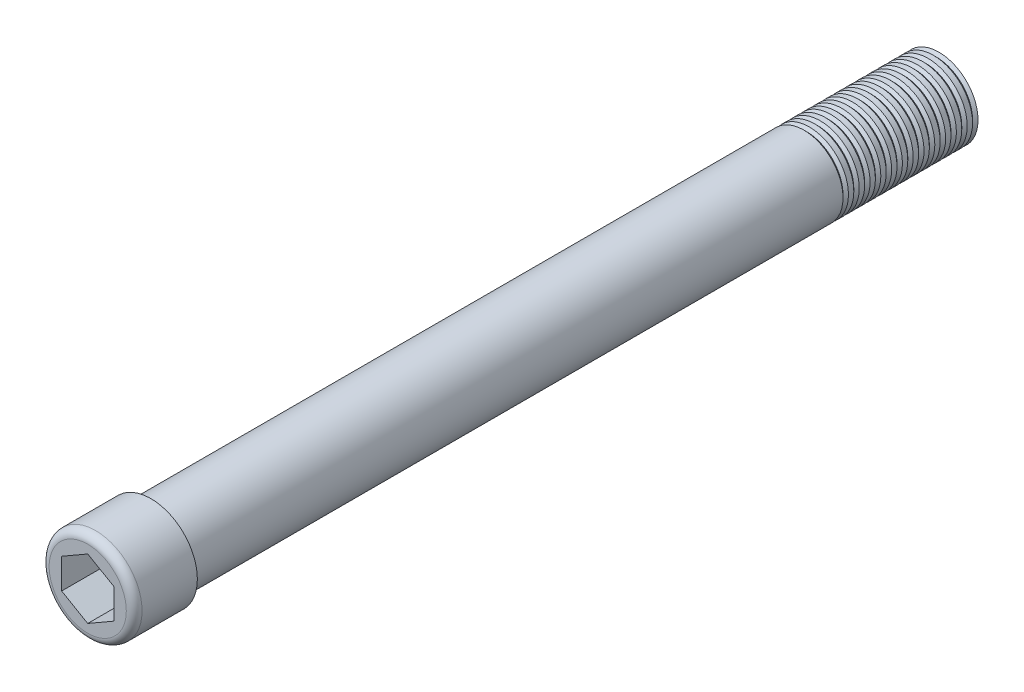
ISO-10303-21;
HEADER;
FILE_DESCRIPTION(('STEP AP214'),'2;1');
FILE_NAME('part.step','',(''),(''),'','','');
FILE_SCHEMA(('AUTOMOTIVE_DESIGN { 1 0 10303 214 1 1 1 1 }'));
ENDSEC;
DATA;
#1=APPLICATION_CONTEXT('core data for automotive mechanical design processes');
#2=APPLICATION_PROTOCOL_DEFINITION('international standard','automotive_design',2000,#1);
#3=PRODUCT_CONTEXT('',#1,'mechanical');
#4=PRODUCT('Part','Part','',(#3));
#5=PRODUCT_RELATED_PRODUCT_CATEGORY('part','',(#4));
#6=PRODUCT_DEFINITION_FORMATION('','',#4);
#7=PRODUCT_DEFINITION_CONTEXT('part definition',#1,'design');
#8=PRODUCT_DEFINITION('design','',#6,#7);
#9=PRODUCT_DEFINITION_SHAPE('','',#8);
#10=(LENGTH_UNIT() NAMED_UNIT(*) SI_UNIT(.MILLI.,.METRE.));
#11=(NAMED_UNIT(*) PLANE_ANGLE_UNIT() SI_UNIT($,.RADIAN.));
#12=(NAMED_UNIT(*) SI_UNIT($,.STERADIAN.) SOLID_ANGLE_UNIT());
#13=UNCERTAINTY_MEASURE_WITH_UNIT(LENGTH_MEASURE(1.E-05),#10,'distance_accuracy_value','');
#14=(GEOMETRIC_REPRESENTATION_CONTEXT(3) GLOBAL_UNCERTAINTY_ASSIGNED_CONTEXT((#13)) GLOBAL_UNIT_ASSIGNED_CONTEXT((#10,
#11,#12)) REPRESENTATION_CONTEXT('',''));
#15=CARTESIAN_POINT('',(0.,0.,0.));
#16=DIRECTION('',(0.,0.,1.));
#17=DIRECTION('',(1.,0.,0.));
#18=AXIS2_PLACEMENT_3D('',#15,#16,#17);
#19=CARTESIAN_POINT('',(0.,0.,127.));
#20=DIRECTION('',(0.,0.,-1.));
#21=DIRECTION('',(-1.,0.,0.));
#22=AXIS2_PLACEMENT_3D('',#19,#20,#21);
#23=CYLINDRICAL_SURFACE('',#22,6.3);
#24=CARTESIAN_POINT('',(0.,0.,20.01735315459));
#25=DIRECTION('',(0.,0.,1.));
#26=DIRECTION('',(1.,0.,0.));
#27=AXIS2_PLACEMENT_3D('',#24,#25,#26);
#28=CIRCLE('',#27,6.3);
#29=CARTESIAN_POINT('',(6.3,0.,20.01735315459));
#30=VERTEX_POINT('',#29);
#31=EDGE_CURVE('E751',#30,#30,#28,.T.);
#32=ORIENTED_EDGE('',*,*,#31,.T.);
#33=EDGE_LOOP('',(#32));
#34=FACE_BOUND('',#33,.T.);
#35=CARTESIAN_POINT('',(0.,0.,20.8799999999999));
#36=DIRECTION('',(0.,0.,1.));
#37=DIRECTION('',(1.,0.,0.));
#38=AXIS2_PLACEMENT_3D('',#35,#36,#37);
#39=CIRCLE('',#38,6.3);
#40=CARTESIAN_POINT('',(6.3,0.,20.8799999999999));
#41=VERTEX_POINT('',#40);
#42=EDGE_CURVE('E765',#41,#41,#39,.T.);
#43=ORIENTED_EDGE('',*,*,#42,.F.);
#44=EDGE_LOOP('',(#43));
#45=FACE_BOUND('',#44,.T.);
#46=ADVANCED_FACE('F31',(#34,#45),#23,.T.);
#47=CARTESIAN_POINT('',(0.,0.,18.27735315459));
#48=DIRECTION('',(0.,0.,1.));
#49=DIRECTION('',(1.,0.,0.));
#50=AXIS2_PLACEMENT_3D('',#47,#48,#49);
#51=CIRCLE('',#50,6.3);
#52=CARTESIAN_POINT('',(6.3,0.,18.27735315459));
#53=VERTEX_POINT('',#52);
#54=EDGE_CURVE('E742',#53,#53,#51,.T.);
#55=ORIENTED_EDGE('',*,*,#54,.T.);
#56=EDGE_LOOP('',(#55));
#57=FACE_BOUND('',#56,.T.);
#58=CARTESIAN_POINT('',(0.,0.,19.1399999999999));
#59=DIRECTION('',(0.,0.,1.));
#60=DIRECTION('',(1.,0.,0.));
#61=AXIS2_PLACEMENT_3D('',#58,#59,#60);
#62=CIRCLE('',#61,6.3);
#63=CARTESIAN_POINT('',(6.3,0.,19.1399999999999));
#64=VERTEX_POINT('',#63);
#65=EDGE_CURVE('E756',#64,#64,#62,.T.);
#66=ORIENTED_EDGE('',*,*,#65,.F.);
#67=EDGE_LOOP('',(#66));
#68=FACE_BOUND('',#67,.T.);
#69=ADVANCED_FACE('F166',(#57,#68),#23,.T.);
#70=CARTESIAN_POINT('',(0.,0.,16.53735315459));
#71=DIRECTION('',(0.,0.,1.));
#72=DIRECTION('',(1.,0.,0.));
#73=AXIS2_PLACEMENT_3D('',#70,#71,#72);
#74=CIRCLE('',#73,6.3);
#75=CARTESIAN_POINT('',(6.3,0.,16.53735315459));
#76=VERTEX_POINT('',#75);
#77=EDGE_CURVE('E733',#76,#76,#74,.T.);
#78=ORIENTED_EDGE('',*,*,#77,.T.);
#79=EDGE_LOOP('',(#78));
#80=FACE_BOUND('',#79,.T.);
#81=CARTESIAN_POINT('',(0.,0.,17.3999999999999));
#82=DIRECTION('',(0.,0.,1.));
#83=DIRECTION('',(1.,0.,0.));
#84=AXIS2_PLACEMENT_3D('',#81,#82,#83);
#85=CIRCLE('',#84,6.3);
#86=CARTESIAN_POINT('',(6.3,0.,17.3999999999999));
#87=VERTEX_POINT('',#86);
#88=EDGE_CURVE('E748',#87,#87,#85,.T.);
#89=ORIENTED_EDGE('',*,*,#88,.F.);
#90=EDGE_LOOP('',(#89));
#91=FACE_BOUND('',#90,.T.);
#92=ADVANCED_FACE('F171',(#80,#91),#23,.T.);
#93=CARTESIAN_POINT('',(0.,0.,14.79735315459));
#94=DIRECTION('',(0.,0.,1.));
#95=DIRECTION('',(1.,0.,0.));
#96=AXIS2_PLACEMENT_3D('',#93,#94,#95);
#97=CIRCLE('',#96,6.3);
#98=CARTESIAN_POINT('',(6.3,0.,14.79735315459));
#99=VERTEX_POINT('',#98);
#100=EDGE_CURVE('E724',#99,#99,#97,.T.);
#101=ORIENTED_EDGE('',*,*,#100,.T.);
#102=EDGE_LOOP('',(#101));
#103=FACE_BOUND('',#102,.T.);
#104=CARTESIAN_POINT('',(0.,0.,15.6599999999999));
#105=DIRECTION('',(0.,0.,1.));
#106=DIRECTION('',(1.,0.,0.));
#107=AXIS2_PLACEMENT_3D('',#104,#105,#106);
#108=CIRCLE('',#107,6.3);
#109=CARTESIAN_POINT('',(6.3,0.,15.6599999999999));
#110=VERTEX_POINT('',#109);
#111=EDGE_CURVE('E739',#110,#110,#108,.T.);
#112=ORIENTED_EDGE('',*,*,#111,.F.);
#113=EDGE_LOOP('',(#112));
#114=FACE_BOUND('',#113,.T.);
#115=ADVANCED_FACE('F396',(#103,#114),#23,.T.);
#116=CARTESIAN_POINT('',(0.,0.,13.05735315459));
#117=DIRECTION('',(0.,0.,1.));
#118=DIRECTION('',(1.,0.,0.));
#119=AXIS2_PLACEMENT_3D('',#116,#117,#118);
#120=CIRCLE('',#119,6.3);
#121=CARTESIAN_POINT('',(6.3,0.,13.05735315459));
#122=VERTEX_POINT('',#121);
#123=EDGE_CURVE('E715',#122,#122,#120,.T.);
#124=ORIENTED_EDGE('',*,*,#123,.T.);
#125=EDGE_LOOP('',(#124));
#126=FACE_BOUND('',#125,.T.);
#127=CARTESIAN_POINT('',(0.,0.,13.92));
#128=DIRECTION('',(0.,0.,1.));
#129=DIRECTION('',(1.,0.,0.));
#130=AXIS2_PLACEMENT_3D('',#127,#128,#129);
#131=CIRCLE('',#130,6.3);
#132=CARTESIAN_POINT('',(6.3,0.,13.92));
#133=VERTEX_POINT('',#132);
#134=EDGE_CURVE('E730',#133,#133,#131,.T.);
#135=ORIENTED_EDGE('',*,*,#134,.F.);
#136=EDGE_LOOP('',(#135));
#137=FACE_BOUND('',#136,.T.);
#138=ADVANCED_FACE('F387',(#126,#137),#23,.T.);
#139=CARTESIAN_POINT('',(0.,0.,11.31735315459));
#140=DIRECTION('',(0.,0.,1.));
#141=DIRECTION('',(1.,0.,0.));
#142=AXIS2_PLACEMENT_3D('',#139,#140,#141);
#143=CIRCLE('',#142,6.3);
#144=CARTESIAN_POINT('',(6.3,0.,11.31735315459));
#145=VERTEX_POINT('',#144);
#146=EDGE_CURVE('E706',#145,#145,#143,.T.);
#147=ORIENTED_EDGE('',*,*,#146,.T.);
#148=EDGE_LOOP('',(#147));
#149=FACE_BOUND('',#148,.T.);
#150=CARTESIAN_POINT('',(0.,0.,12.18));
#151=DIRECTION('',(0.,0.,1.));
#152=DIRECTION('',(1.,0.,0.));
#153=AXIS2_PLACEMENT_3D('',#150,#151,#152);
#154=CIRCLE('',#153,6.3);
#155=CARTESIAN_POINT('',(6.3,0.,12.18));
#156=VERTEX_POINT('',#155);
#157=EDGE_CURVE('E721',#156,#156,#154,.T.);
#158=ORIENTED_EDGE('',*,*,#157,.F.);
#159=EDGE_LOOP('',(#158));
#160=FACE_BOUND('',#159,.T.);
#161=ADVANCED_FACE('F378',(#149,#160),#23,.T.);
#162=CARTESIAN_POINT('',(0.,0.,9.57735315459));
#163=DIRECTION('',(0.,0.,1.));
#164=DIRECTION('',(1.,0.,0.));
#165=AXIS2_PLACEMENT_3D('',#162,#163,#164);
#166=CIRCLE('',#165,6.3);
#167=CARTESIAN_POINT('',(6.3,0.,9.57735315459));
#168=VERTEX_POINT('',#167);
#169=EDGE_CURVE('E694',#168,#168,#166,.T.);
#170=ORIENTED_EDGE('',*,*,#169,.T.);
#171=EDGE_LOOP('',(#170));
#172=FACE_BOUND('',#171,.T.);
#173=CARTESIAN_POINT('',(0.,0.,10.44));
#174=DIRECTION('',(0.,0.,1.));
#175=DIRECTION('',(1.,0.,0.));
#176=AXIS2_PLACEMENT_3D('',#173,#174,#175);
#177=CIRCLE('',#176,6.3);
#178=CARTESIAN_POINT('',(6.3,0.,10.44));
#179=VERTEX_POINT('',#178);
#180=EDGE_CURVE('E712',#179,#179,#177,.T.);
#181=ORIENTED_EDGE('',*,*,#180,.F.);
#182=EDGE_LOOP('',(#181));
#183=FACE_BOUND('',#182,.T.);
#184=ADVANCED_FACE('F369',(#172,#183),#23,.T.);
#185=CARTESIAN_POINT('',(0.,0.,7.83735315459001));
#186=DIRECTION('',(0.,0.,1.));
#187=DIRECTION('',(1.,0.,0.));
#188=AXIS2_PLACEMENT_3D('',#185,#186,#187);
#189=CIRCLE('',#188,6.3);
#190=CARTESIAN_POINT('',(6.3,0.,7.83735315459001));
#191=VERTEX_POINT('',#190);
#192=EDGE_CURVE('E238',#191,#191,#189,.T.);
#193=ORIENTED_EDGE('',*,*,#192,.T.);
#194=EDGE_LOOP('',(#193));
#195=FACE_BOUND('',#194,.T.);
#196=CARTESIAN_POINT('',(0.,0.,8.69999999999997));
#197=DIRECTION('',(0.,0.,1.));
#198=DIRECTION('',(1.,0.,0.));
#199=AXIS2_PLACEMENT_3D('',#196,#197,#198);
#200=CIRCLE('',#199,6.3);
#201=CARTESIAN_POINT('',(6.3,0.,8.69999999999997));
#202=VERTEX_POINT('',#201);
#203=EDGE_CURVE('E703',#202,#202,#200,.T.);
#204=ORIENTED_EDGE('',*,*,#203,.F.);
#205=EDGE_LOOP('',(#204));
#206=FACE_BOUND('',#205,.T.);
#207=ADVANCED_FACE('F227',(#195,#206),#23,.T.);
#208=CARTESIAN_POINT('',(0.,0.,6.09735315459002));
#209=DIRECTION('',(0.,0.,1.));
#210=DIRECTION('',(1.,0.,0.));
#211=AXIS2_PLACEMENT_3D('',#208,#209,#210);
#212=CIRCLE('',#211,6.3);
#213=CARTESIAN_POINT('',(6.3,0.,6.09735315459002));
#214=VERTEX_POINT('',#213);
#215=EDGE_CURVE('E241',#214,#214,#212,.T.);
#216=ORIENTED_EDGE('',*,*,#215,.T.);
#217=EDGE_LOOP('',(#216));
#218=FACE_BOUND('',#217,.T.);
#219=CARTESIAN_POINT('',(0.,0.,6.95999999999998));
#220=DIRECTION('',(0.,0.,1.));
#221=DIRECTION('',(1.,0.,0.));
#222=AXIS2_PLACEMENT_3D('',#219,#220,#221);
#223=CIRCLE('',#222,6.3);
#224=CARTESIAN_POINT('',(6.3,0.,6.95999999999998));
#225=VERTEX_POINT('',#224);
#226=EDGE_CURVE('E693',#225,#225,#223,.T.);
#227=ORIENTED_EDGE('',*,*,#226,.F.);
#228=EDGE_LOOP('',(#227));
#229=FACE_BOUND('',#228,.T.);
#230=ADVANCED_FACE('F218',(#218,#229),#23,.T.);
#231=CARTESIAN_POINT('',(0.,0.,4.35735315459002));
#232=DIRECTION('',(0.,0.,1.));
#233=DIRECTION('',(1.,0.,0.));
#234=AXIS2_PLACEMENT_3D('',#231,#232,#233);
#235=CIRCLE('',#234,6.3);
#236=CARTESIAN_POINT('',(6.3,0.,4.35735315459002));
#237=VERTEX_POINT('',#236);
#238=EDGE_CURVE('E232',#237,#237,#235,.T.);
#239=ORIENTED_EDGE('',*,*,#238,.T.);
#240=EDGE_LOOP('',(#239));
#241=FACE_BOUND('',#240,.T.);
#242=CARTESIAN_POINT('',(0.,0.,5.21999999999998));
#243=DIRECTION('',(0.,0.,1.));
#244=DIRECTION('',(1.,0.,0.));
#245=AXIS2_PLACEMENT_3D('',#242,#243,#244);
#246=CIRCLE('',#245,6.3);
#247=CARTESIAN_POINT('',(6.3,0.,5.21999999999998));
#248=VERTEX_POINT('',#247);
#249=EDGE_CURVE('E235',#248,#248,#246,.T.);
#250=ORIENTED_EDGE('',*,*,#249,.F.);
#251=EDGE_LOOP('',(#250));
#252=FACE_BOUND('',#251,.T.);
#253=ADVANCED_FACE('F204',(#241,#252),#23,.T.);
#254=CARTESIAN_POINT('',(0.,0.,4.35735315459002));
#255=DIRECTION('',(0.,0.,1.));
#256=DIRECTION('',(1.,0.,0.));
#257=AXIS2_PLACEMENT_3D('',#254,#255,#256);
#258=CONICAL_SURFACE('',#257,6.3,0.785398163397411);
#259=CARTESIAN_POINT('',(0.,0.,3.91867657729498));
#260=DIRECTION('',(0.,0.,1.));
#261=DIRECTION('',(1.,0.,0.));
#262=AXIS2_PLACEMENT_3D('',#259,#260,#261);
#263=CIRCLE('',#262,5.86132342270499);
#264=CARTESIAN_POINT('',(5.86132342270499,0.,3.91867657729498));
#265=VERTEX_POINT('',#264);
#266=EDGE_CURVE('E253',#265,#265,#263,.T.);
#267=ORIENTED_EDGE('',*,*,#266,.T.);
#268=EDGE_LOOP('',(#267));
#269=FACE_BOUND('',#268,.T.);
#270=ORIENTED_EDGE('',*,*,#238,.F.);
#271=EDGE_LOOP('',(#270));
#272=FACE_BOUND('',#271,.T.);
#273=ADVANCED_FACE('F217',(#269,#272),#258,.T.);
#274=CARTESIAN_POINT('',(0.,0.,3.91867657729498));
#275=DIRECTION('',(0.,0.,-1.));
#276=DIRECTION('',(-1.,0.,0.));
#277=AXIS2_PLACEMENT_3D('',#274,#275,#276);
#278=CONICAL_SURFACE('',#277,5.86132342270499,0.785398163397474);
#279=CARTESIAN_POINT('',(0.,0.,3.47999999999999));
#280=DIRECTION('',(0.,0.,1.));
#281=DIRECTION('',(1.,0.,0.));
#282=AXIS2_PLACEMENT_3D('',#279,#280,#281);
#283=CIRCLE('',#282,6.3);
#284=CARTESIAN_POINT('',(6.3,0.,3.47999999999999));
#285=VERTEX_POINT('',#284);
#286=EDGE_CURVE('E250',#285,#285,#283,.T.);
#287=ORIENTED_EDGE('',*,*,#286,.T.);
#288=EDGE_LOOP('',(#287));
#289=FACE_BOUND('',#288,.T.);
#290=ORIENTED_EDGE('',*,*,#266,.F.);
#291=EDGE_LOOP('',(#290));
#292=FACE_BOUND('',#291,.T.);
#293=ADVANCED_FACE('F224',(#289,#292),#278,.T.);
#294=CARTESIAN_POINT('',(0.,0.,0.));
#295=DIRECTION('',(0.,0.,1.));
#296=DIRECTION('',(1.,0.,0.));
#297=AXIS2_PLACEMENT_3D('',#294,#295,#296);
#298=PLANE('',#297);
#299=CARTESIAN_POINT('',(0.,0.,0.));
#300=DIRECTION('',(0.,0.,1.));
#301=DIRECTION('',(1.,0.,0.));
#302=AXIS2_PLACEMENT_3D('',#299,#300,#301);
#303=CIRCLE('',#302,6.3);
#304=CARTESIAN_POINT('',(6.3,0.,0.));
#305=VERTEX_POINT('',#304);
#306=EDGE_CURVE('E265',#305,#305,#303,.T.);
#307=ORIENTED_EDGE('',*,*,#306,.F.);
#308=EDGE_LOOP('',(#307));
#309=FACE_BOUND('',#308,.T.);
#310=ADVANCED_FACE('F277',(#309),#298,.F.);
#311=CARTESIAN_POINT('',(0.,0.,0.438676577294989));
#312=DIRECTION('',(0.,0.,-1.));
#313=DIRECTION('',(-1.,0.,0.));
#314=AXIS2_PLACEMENT_3D('',#311,#312,#313);
#315=CONICAL_SURFACE('',#314,5.86132342270499,0.785398163397474);
#316=ORIENTED_EDGE('',*,*,#306,.T.);
#317=EDGE_LOOP('',(#316));
#318=FACE_BOUND('',#317,.T.);
#319=CARTESIAN_POINT('',(0.,0.,0.438676577294989));
#320=DIRECTION('',(0.,0.,1.));
#321=DIRECTION('',(1.,0.,0.));
#322=AXIS2_PLACEMENT_3D('',#319,#320,#321);
#323=CIRCLE('',#322,5.86132342270499);
#324=CARTESIAN_POINT('',(5.86132342270499,0.,0.438676577294989));
#325=VERTEX_POINT('',#324);
#326=EDGE_CURVE('E268',#325,#325,#323,.T.);
#327=ORIENTED_EDGE('',*,*,#326,.F.);
#328=EDGE_LOOP('',(#327));
#329=FACE_BOUND('',#328,.T.);
#330=ADVANCED_FACE('F196',(#318,#329),#315,.T.);
#331=CARTESIAN_POINT('',(0.,0.,0.877353154590033));
#332=DIRECTION('',(0.,0.,1.));
#333=DIRECTION('',(1.,0.,0.));
#334=AXIS2_PLACEMENT_3D('',#331,#332,#333);
#335=CONICAL_SURFACE('',#334,6.3,0.785398163397411);
#336=ORIENTED_EDGE('',*,*,#326,.T.);
#337=EDGE_LOOP('',(#336));
#338=FACE_BOUND('',#337,.T.);
#339=CARTESIAN_POINT('',(0.,0.,0.877353154590033));
#340=DIRECTION('',(0.,0.,1.));
#341=DIRECTION('',(1.,0.,0.));
#342=AXIS2_PLACEMENT_3D('',#339,#340,#341);
#343=CIRCLE('',#342,6.3);
#344=CARTESIAN_POINT('',(6.3,0.,0.877353154590033));
#345=VERTEX_POINT('',#344);
#346=EDGE_CURVE('E271',#345,#345,#343,.T.);
#347=ORIENTED_EDGE('',*,*,#346,.F.);
#348=EDGE_LOOP('',(#347));
#349=FACE_BOUND('',#348,.T.);
#350=ADVANCED_FACE('F186',(#338,#349),#335,.T.);
#351=ORIENTED_EDGE('',*,*,#346,.T.);
#352=EDGE_LOOP('',(#351));
#353=FACE_BOUND('',#352,.T.);
#354=CARTESIAN_POINT('',(0.,0.,1.73999999999999));
#355=DIRECTION('',(0.,0.,1.));
#356=DIRECTION('',(1.,0.,0.));
#357=AXIS2_PLACEMENT_3D('',#354,#355,#356);
#358=CIRCLE('',#357,6.3);
#359=CARTESIAN_POINT('',(6.3,0.,1.73999999999999));
#360=VERTEX_POINT('',#359);
#361=EDGE_CURVE('E257',#360,#360,#358,.T.);
#362=ORIENTED_EDGE('',*,*,#361,.F.);
#363=EDGE_LOOP('',(#362));
#364=FACE_BOUND('',#363,.T.);
#365=ADVANCED_FACE('F177',(#353,#364),#23,.T.);
#366=CARTESIAN_POINT('',(0.,0.,2.17867657729498));
#367=DIRECTION('',(0.,0.,-1.));
#368=DIRECTION('',(-1.,0.,0.));
#369=AXIS2_PLACEMENT_3D('',#366,#367,#368);
#370=CONICAL_SURFACE('',#369,5.86132342270499,0.785398163397474);
#371=ORIENTED_EDGE('',*,*,#361,.T.);
#372=EDGE_LOOP('',(#371));
#373=FACE_BOUND('',#372,.T.);
#374=CARTESIAN_POINT('',(0.,0.,2.17867657729498));
#375=DIRECTION('',(0.,0.,1.));
#376=DIRECTION('',(1.,0.,0.));
#377=AXIS2_PLACEMENT_3D('',#374,#375,#376);
#378=CIRCLE('',#377,5.86132342270499);
#379=CARTESIAN_POINT('',(5.86132342270499,0.,2.17867657729498));
#380=VERTEX_POINT('',#379);
#381=EDGE_CURVE('E260',#380,#380,#378,.T.);
#382=ORIENTED_EDGE('',*,*,#381,.F.);
#383=EDGE_LOOP('',(#382));
#384=FACE_BOUND('',#383,.T.);
#385=ADVANCED_FACE('F185',(#373,#384),#370,.T.);
#386=CARTESIAN_POINT('',(0.,0.,2.61735315459003));
#387=DIRECTION('',(0.,0.,1.));
#388=DIRECTION('',(1.,0.,0.));
#389=AXIS2_PLACEMENT_3D('',#386,#387,#388);
#390=CONICAL_SURFACE('',#389,6.3,0.785398163397411);
#391=ORIENTED_EDGE('',*,*,#381,.T.);
#392=EDGE_LOOP('',(#391));
#393=FACE_BOUND('',#392,.T.);
#394=CARTESIAN_POINT('',(0.,0.,2.61735315459003));
#395=DIRECTION('',(0.,0.,1.));
#396=DIRECTION('',(1.,0.,0.));
#397=AXIS2_PLACEMENT_3D('',#394,#395,#396);
#398=CIRCLE('',#397,6.3);
#399=CARTESIAN_POINT('',(6.3,0.,2.61735315459003));
#400=VERTEX_POINT('',#399);
#401=EDGE_CURVE('E263',#400,#400,#398,.T.);
#402=ORIENTED_EDGE('',*,*,#401,.F.);
#403=EDGE_LOOP('',(#402));
#404=FACE_BOUND('',#403,.T.);
#405=ADVANCED_FACE('F193',(#393,#404),#390,.T.);
#406=ORIENTED_EDGE('',*,*,#401,.T.);
#407=EDGE_LOOP('',(#406));
#408=FACE_BOUND('',#407,.T.);
#409=ORIENTED_EDGE('',*,*,#286,.F.);
#410=EDGE_LOOP('',(#409));
#411=FACE_BOUND('',#410,.T.);
#412=ADVANCED_FACE('F188',(#408,#411),#23,.T.);
#413=CARTESIAN_POINT('',(0.,0.,6.09735315459002));
#414=DIRECTION('',(0.,0.,1.));
#415=DIRECTION('',(1.,0.,0.));
#416=AXIS2_PLACEMENT_3D('',#413,#414,#415);
#417=CONICAL_SURFACE('',#416,6.3,0.785398163397411);
#418=CARTESIAN_POINT('',(0.,0.,5.65867657729497));
#419=DIRECTION('',(0.,0.,1.));
#420=DIRECTION('',(1.,0.,0.));
#421=AXIS2_PLACEMENT_3D('',#418,#419,#420);
#422=CIRCLE('',#421,5.86132342270499);
#423=CARTESIAN_POINT('',(5.86132342270499,0.,5.65867657729497));
#424=VERTEX_POINT('',#423);
#425=EDGE_CURVE('E237',#424,#424,#422,.T.);
#426=ORIENTED_EDGE('',*,*,#425,.T.);
#427=EDGE_LOOP('',(#426));
#428=FACE_BOUND('',#427,.T.);
#429=ORIENTED_EDGE('',*,*,#215,.F.);
#430=EDGE_LOOP('',(#429));
#431=FACE_BOUND('',#430,.T.);
#432=ADVANCED_FACE('F202',(#428,#431),#417,.T.);
#433=CARTESIAN_POINT('',(0.,0.,5.65867657729497));
#434=DIRECTION('',(0.,0.,-1.));
#435=DIRECTION('',(-1.,0.,0.));
#436=AXIS2_PLACEMENT_3D('',#433,#434,#435);
#437=CONICAL_SURFACE('',#436,5.86132342270499,0.785398163397474);
#438=ORIENTED_EDGE('',*,*,#249,.T.);
#439=EDGE_LOOP('',(#438));
#440=FACE_BOUND('',#439,.T.);
#441=ORIENTED_EDGE('',*,*,#425,.F.);
#442=EDGE_LOOP('',(#441));
#443=FACE_BOUND('',#442,.T.);
#444=ADVANCED_FACE('F209',(#440,#443),#437,.T.);
#445=CARTESIAN_POINT('',(0.,0.,7.83735315459001));
#446=DIRECTION('',(0.,0.,1.));
#447=DIRECTION('',(1.,0.,0.));
#448=AXIS2_PLACEMENT_3D('',#445,#446,#447);
#449=CONICAL_SURFACE('',#448,6.3,0.785398163397411);
#450=CARTESIAN_POINT('',(0.,0.,7.39867657729496));
#451=DIRECTION('',(0.,0.,1.));
#452=DIRECTION('',(1.,0.,0.));
#453=AXIS2_PLACEMENT_3D('',#450,#451,#452);
#454=CIRCLE('',#453,5.86132342270499);
#455=CARTESIAN_POINT('',(5.86132342270499,0.,7.39867657729496));
#456=VERTEX_POINT('',#455);
#457=EDGE_CURVE('E244',#456,#456,#454,.T.);
#458=ORIENTED_EDGE('',*,*,#457,.T.);
#459=EDGE_LOOP('',(#458));
#460=FACE_BOUND('',#459,.T.);
#461=ORIENTED_EDGE('',*,*,#192,.F.);
#462=EDGE_LOOP('',(#461));
#463=FACE_BOUND('',#462,.T.);
#464=ADVANCED_FACE('F605',(#460,#463),#449,.T.);
#465=CARTESIAN_POINT('',(0.,0.,7.39867657729496));
#466=DIRECTION('',(0.,0.,-1.));
#467=DIRECTION('',(-1.,0.,0.));
#468=AXIS2_PLACEMENT_3D('',#465,#466,#467);
#469=CONICAL_SURFACE('',#468,5.86132342270499,0.785398163397474);
#470=ORIENTED_EDGE('',*,*,#226,.T.);
#471=EDGE_LOOP('',(#470));
#472=FACE_BOUND('',#471,.T.);
#473=ORIENTED_EDGE('',*,*,#457,.F.);
#474=EDGE_LOOP('',(#473));
#475=FACE_BOUND('',#474,.T.);
#476=ADVANCED_FACE('F597',(#472,#475),#469,.T.);
#477=CARTESIAN_POINT('',(0.,0.,9.57735315459));
#478=DIRECTION('',(0.,0.,1.));
#479=DIRECTION('',(1.,0.,0.));
#480=AXIS2_PLACEMENT_3D('',#477,#478,#479);
#481=CONICAL_SURFACE('',#480,6.3,0.785398163397411);
#482=CARTESIAN_POINT('',(0.,0.,9.13867657729496));
#483=DIRECTION('',(0.,0.,1.));
#484=DIRECTION('',(1.,0.,0.));
#485=AXIS2_PLACEMENT_3D('',#482,#483,#484);
#486=CIRCLE('',#485,5.86132342270499);
#487=CARTESIAN_POINT('',(5.86132342270499,0.,9.13867657729496));
#488=VERTEX_POINT('',#487);
#489=EDGE_CURVE('E698',#488,#488,#486,.T.);
#490=ORIENTED_EDGE('',*,*,#489,.T.);
#491=EDGE_LOOP('',(#490));
#492=FACE_BOUND('',#491,.T.);
#493=ORIENTED_EDGE('',*,*,#169,.F.);
#494=EDGE_LOOP('',(#493));
#495=FACE_BOUND('',#494,.T.);
#496=ADVANCED_FACE('F589',(#492,#495),#481,.T.);
#497=CARTESIAN_POINT('',(0.,0.,9.13867657729496));
#498=DIRECTION('',(0.,0.,-1.));
#499=DIRECTION('',(-1.,0.,0.));
#500=AXIS2_PLACEMENT_3D('',#497,#498,#499);
#501=CONICAL_SURFACE('',#500,5.86132342270499,0.785398163397474);
#502=ORIENTED_EDGE('',*,*,#203,.T.);
#503=EDGE_LOOP('',(#502));
#504=FACE_BOUND('',#503,.T.);
#505=ORIENTED_EDGE('',*,*,#489,.F.);
#506=EDGE_LOOP('',(#505));
#507=FACE_BOUND('',#506,.T.);
#508=ADVANCED_FACE('F581',(#504,#507),#501,.T.);
#509=CARTESIAN_POINT('',(0.,0.,11.31735315459));
#510=DIRECTION('',(0.,0.,1.));
#511=DIRECTION('',(1.,0.,0.));
#512=AXIS2_PLACEMENT_3D('',#509,#510,#511);
#513=CONICAL_SURFACE('',#512,6.3,0.785398163397411);
#514=CARTESIAN_POINT('',(0.,0.,10.878676577295));
#515=DIRECTION('',(0.,0.,1.));
#516=DIRECTION('',(1.,0.,0.));
#517=AXIS2_PLACEMENT_3D('',#514,#515,#516);
#518=CIRCLE('',#517,5.86132342270499);
#519=CARTESIAN_POINT('',(5.86132342270499,0.,10.878676577295));
#520=VERTEX_POINT('',#519);
#521=EDGE_CURVE('E709',#520,#520,#518,.T.);
#522=ORIENTED_EDGE('',*,*,#521,.T.);
#523=EDGE_LOOP('',(#522));
#524=FACE_BOUND('',#523,.T.);
#525=ORIENTED_EDGE('',*,*,#146,.F.);
#526=EDGE_LOOP('',(#525));
#527=FACE_BOUND('',#526,.T.);
#528=ADVANCED_FACE('F573',(#524,#527),#513,.T.);
#529=CARTESIAN_POINT('',(0.,0.,10.878676577295));
#530=DIRECTION('',(0.,0.,-1.));
#531=DIRECTION('',(-1.,0.,0.));
#532=AXIS2_PLACEMENT_3D('',#529,#530,#531);
#533=CONICAL_SURFACE('',#532,5.86132342270499,0.785398163397474);
#534=ORIENTED_EDGE('',*,*,#180,.T.);
#535=EDGE_LOOP('',(#534));
#536=FACE_BOUND('',#535,.T.);
#537=ORIENTED_EDGE('',*,*,#521,.F.);
#538=EDGE_LOOP('',(#537));
#539=FACE_BOUND('',#538,.T.);
#540=ADVANCED_FACE('F565',(#536,#539),#533,.T.);
#541=CARTESIAN_POINT('',(0.,0.,13.05735315459));
#542=DIRECTION('',(0.,0.,1.));
#543=DIRECTION('',(1.,0.,0.));
#544=AXIS2_PLACEMENT_3D('',#541,#542,#543);
#545=CONICAL_SURFACE('',#544,6.3,0.785398163397411);
#546=CARTESIAN_POINT('',(0.,0.,12.6186765772949));
#547=DIRECTION('',(0.,0.,1.));
#548=DIRECTION('',(1.,0.,0.));
#549=AXIS2_PLACEMENT_3D('',#546,#547,#548);
#550=CIRCLE('',#549,5.86132342270499);
#551=CARTESIAN_POINT('',(5.86132342270499,0.,12.6186765772949));
#552=VERTEX_POINT('',#551);
#553=EDGE_CURVE('E718',#552,#552,#550,.T.);
#554=ORIENTED_EDGE('',*,*,#553,.T.);
#555=EDGE_LOOP('',(#554));
#556=FACE_BOUND('',#555,.T.);
#557=ORIENTED_EDGE('',*,*,#123,.F.);
#558=EDGE_LOOP('',(#557));
#559=FACE_BOUND('',#558,.T.);
#560=ADVANCED_FACE('F557',(#556,#559),#545,.T.);
#561=CARTESIAN_POINT('',(0.,0.,12.6186765772949));
#562=DIRECTION('',(0.,0.,-1.));
#563=DIRECTION('',(-1.,0.,0.));
#564=AXIS2_PLACEMENT_3D('',#561,#562,#563);
#565=CONICAL_SURFACE('',#564,5.86132342270499,0.785398163397474);
#566=ORIENTED_EDGE('',*,*,#157,.T.);
#567=EDGE_LOOP('',(#566));
#568=FACE_BOUND('',#567,.T.);
#569=ORIENTED_EDGE('',*,*,#553,.F.);
#570=EDGE_LOOP('',(#569));
#571=FACE_BOUND('',#570,.T.);
#572=ADVANCED_FACE('F549',(#568,#571),#565,.T.);
#573=CARTESIAN_POINT('',(0.,0.,14.79735315459));
#574=DIRECTION('',(0.,0.,1.));
#575=DIRECTION('',(1.,0.,0.));
#576=AXIS2_PLACEMENT_3D('',#573,#574,#575);
#577=CONICAL_SURFACE('',#576,6.3,0.785398163397411);
#578=CARTESIAN_POINT('',(0.,0.,14.3586765772949));
#579=DIRECTION('',(0.,0.,1.));
#580=DIRECTION('',(1.,0.,0.));
#581=AXIS2_PLACEMENT_3D('',#578,#579,#580);
#582=CIRCLE('',#581,5.86132342270499);
#583=CARTESIAN_POINT('',(5.86132342270499,0.,14.3586765772949));
#584=VERTEX_POINT('',#583);
#585=EDGE_CURVE('E727',#584,#584,#582,.T.);
#586=ORIENTED_EDGE('',*,*,#585,.T.);
#587=EDGE_LOOP('',(#586));
#588=FACE_BOUND('',#587,.T.);
#589=ORIENTED_EDGE('',*,*,#100,.F.);
#590=EDGE_LOOP('',(#589));
#591=FACE_BOUND('',#590,.T.);
#592=ADVANCED_FACE('F541',(#588,#591),#577,.T.);
#593=CARTESIAN_POINT('',(0.,0.,14.3586765772949));
#594=DIRECTION('',(0.,0.,-1.));
#595=DIRECTION('',(-1.,0.,0.));
#596=AXIS2_PLACEMENT_3D('',#593,#594,#595);
#597=CONICAL_SURFACE('',#596,5.86132342270499,0.785398163397474);
#598=ORIENTED_EDGE('',*,*,#134,.T.);
#599=EDGE_LOOP('',(#598));
#600=FACE_BOUND('',#599,.T.);
#601=ORIENTED_EDGE('',*,*,#585,.F.);
#602=EDGE_LOOP('',(#601));
#603=FACE_BOUND('',#602,.T.);
#604=ADVANCED_FACE('F533',(#600,#603),#597,.T.);
#605=CARTESIAN_POINT('',(0.,0.,16.53735315459));
#606=DIRECTION('',(0.,0.,1.));
#607=DIRECTION('',(1.,0.,0.));
#608=AXIS2_PLACEMENT_3D('',#605,#606,#607);
#609=CONICAL_SURFACE('',#608,6.3,0.785398163397411);
#610=CARTESIAN_POINT('',(0.,0.,16.0986765772949));
#611=DIRECTION('',(0.,0.,1.));
#612=DIRECTION('',(1.,0.,0.));
#613=AXIS2_PLACEMENT_3D('',#610,#611,#612);
#614=CIRCLE('',#613,5.86132342270499);
#615=CARTESIAN_POINT('',(5.86132342270499,0.,16.0986765772949));
#616=VERTEX_POINT('',#615);
#617=EDGE_CURVE('E736',#616,#616,#614,.T.);
#618=ORIENTED_EDGE('',*,*,#617,.T.);
#619=EDGE_LOOP('',(#618));
#620=FACE_BOUND('',#619,.T.);
#621=ORIENTED_EDGE('',*,*,#77,.F.);
#622=EDGE_LOOP('',(#621));
#623=FACE_BOUND('',#622,.T.);
#624=ADVANCED_FACE('F525',(#620,#623),#609,.T.);
#625=CARTESIAN_POINT('',(0.,0.,16.0986765772949));
#626=DIRECTION('',(0.,0.,-1.));
#627=DIRECTION('',(-1.,0.,0.));
#628=AXIS2_PLACEMENT_3D('',#625,#626,#627);
#629=CONICAL_SURFACE('',#628,5.86132342270499,0.785398163397474);
#630=ORIENTED_EDGE('',*,*,#111,.T.);
#631=EDGE_LOOP('',(#630));
#632=FACE_BOUND('',#631,.T.);
#633=ORIENTED_EDGE('',*,*,#617,.F.);
#634=EDGE_LOOP('',(#633));
#635=FACE_BOUND('',#634,.T.);
#636=ADVANCED_FACE('F517',(#632,#635),#629,.T.);
#637=CARTESIAN_POINT('',(0.,0.,18.27735315459));
#638=DIRECTION('',(0.,0.,1.));
#639=DIRECTION('',(1.,0.,0.));
#640=AXIS2_PLACEMENT_3D('',#637,#638,#639);
#641=CONICAL_SURFACE('',#640,6.3,0.785398163397411);
#642=CARTESIAN_POINT('',(0.,0.,17.8386765772949));
#643=DIRECTION('',(0.,0.,1.));
#644=DIRECTION('',(1.,0.,0.));
#645=AXIS2_PLACEMENT_3D('',#642,#643,#644);
#646=CIRCLE('',#645,5.86132342270499);
#647=CARTESIAN_POINT('',(5.86132342270499,0.,17.8386765772949));
#648=VERTEX_POINT('',#647);
#649=EDGE_CURVE('E745',#648,#648,#646,.T.);
#650=ORIENTED_EDGE('',*,*,#649,.T.);
#651=EDGE_LOOP('',(#650));
#652=FACE_BOUND('',#651,.T.);
#653=ORIENTED_EDGE('',*,*,#54,.F.);
#654=EDGE_LOOP('',(#653));
#655=FACE_BOUND('',#654,.T.);
#656=ADVANCED_FACE('F509',(#652,#655),#641,.T.);
#657=CARTESIAN_POINT('',(0.,0.,17.8386765772949));
#658=DIRECTION('',(0.,0.,-1.));
#659=DIRECTION('',(-1.,0.,0.));
#660=AXIS2_PLACEMENT_3D('',#657,#658,#659);
#661=CONICAL_SURFACE('',#660,5.86132342270499,0.785398163397474);
#662=ORIENTED_EDGE('',*,*,#88,.T.);
#663=EDGE_LOOP('',(#662));
#664=FACE_BOUND('',#663,.T.);
#665=ORIENTED_EDGE('',*,*,#649,.F.);
#666=EDGE_LOOP('',(#665));
#667=FACE_BOUND('',#666,.T.);
#668=ADVANCED_FACE('F501',(#664,#667),#661,.T.);
#669=CARTESIAN_POINT('',(0.,0.,20.01735315459));
#670=DIRECTION('',(0.,0.,1.));
#671=DIRECTION('',(1.,0.,0.));
#672=AXIS2_PLACEMENT_3D('',#669,#670,#671);
#673=CONICAL_SURFACE('',#672,6.3,0.785398163397411);
#674=CARTESIAN_POINT('',(0.,0.,19.5786765772949));
#675=DIRECTION('',(0.,0.,1.));
#676=DIRECTION('',(1.,0.,0.));
#677=AXIS2_PLACEMENT_3D('',#674,#675,#676);
#678=CIRCLE('',#677,5.86132342270499);
#679=CARTESIAN_POINT('',(5.86132342270499,0.,19.5786765772949));
#680=VERTEX_POINT('',#679);
#681=EDGE_CURVE('E753',#680,#680,#678,.T.);
#682=ORIENTED_EDGE('',*,*,#681,.T.);
#683=EDGE_LOOP('',(#682));
#684=FACE_BOUND('',#683,.T.);
#685=ORIENTED_EDGE('',*,*,#31,.F.);
#686=EDGE_LOOP('',(#685));
#687=FACE_BOUND('',#686,.T.);
#688=ADVANCED_FACE('F493',(#684,#687),#673,.T.);
#689=CARTESIAN_POINT('',(0.,0.,19.5786765772949));
#690=DIRECTION('',(0.,0.,-1.));
#691=DIRECTION('',(-1.,0.,0.));
#692=AXIS2_PLACEMENT_3D('',#689,#690,#691);
#693=CONICAL_SURFACE('',#692,5.86132342270499,0.785398163397474);
#694=ORIENTED_EDGE('',*,*,#65,.T.);
#695=EDGE_LOOP('',(#694));
#696=FACE_BOUND('',#695,.T.);
#697=ORIENTED_EDGE('',*,*,#681,.F.);
#698=EDGE_LOOP('',(#697));
#699=FACE_BOUND('',#698,.T.);
#700=ADVANCED_FACE('F485',(#696,#699),#693,.T.);
#701=CARTESIAN_POINT('',(0.,0.,21.75735315459));
#702=DIRECTION('',(0.,0.,1.));
#703=DIRECTION('',(1.,0.,0.));
#704=AXIS2_PLACEMENT_3D('',#701,#702,#703);
#705=CONICAL_SURFACE('',#704,6.3,0.785398163397411);
#706=CARTESIAN_POINT('',(0.,0.,21.3186765772949));
#707=DIRECTION('',(0.,0.,1.));
#708=DIRECTION('',(1.,0.,0.));
#709=AXIS2_PLACEMENT_3D('',#706,#707,#708);
#710=CIRCLE('',#709,5.86132342270499);
#711=CARTESIAN_POINT('',(5.86132342270499,0.,21.3186765772949));
#712=VERTEX_POINT('',#711);
#713=EDGE_CURVE('E762',#712,#712,#710,.T.);
#714=ORIENTED_EDGE('',*,*,#713,.T.);
#715=EDGE_LOOP('',(#714));
#716=FACE_BOUND('',#715,.T.);
#717=CARTESIAN_POINT('',(0.,0.,21.75735315459));
#718=DIRECTION('',(0.,0.,1.));
#719=DIRECTION('',(1.,0.,0.));
#720=AXIS2_PLACEMENT_3D('',#717,#718,#719);
#721=CIRCLE('',#720,6.3);
#722=CARTESIAN_POINT('',(6.3,0.,21.75735315459));
#723=VERTEX_POINT('',#722);
#724=EDGE_CURVE('E759',#723,#723,#721,.T.);
#725=ORIENTED_EDGE('',*,*,#724,.F.);
#726=EDGE_LOOP('',(#725));
#727=FACE_BOUND('',#726,.T.);
#728=ADVANCED_FACE('F477',(#716,#727),#705,.T.);
#729=CARTESIAN_POINT('',(0.,0.,21.3186765772949));
#730=DIRECTION('',(0.,0.,-1.));
#731=DIRECTION('',(-1.,0.,0.));
#732=AXIS2_PLACEMENT_3D('',#729,#730,#731);
#733=CONICAL_SURFACE('',#732,5.86132342270499,0.785398163397474);
#734=ORIENTED_EDGE('',*,*,#42,.T.);
#735=EDGE_LOOP('',(#734));
#736=FACE_BOUND('',#735,.T.);
#737=ORIENTED_EDGE('',*,*,#713,.F.);
#738=EDGE_LOOP('',(#737));
#739=FACE_BOUND('',#738,.T.);
#740=ADVANCED_FACE('F288',(#736,#739),#733,.T.);
#741=CARTESIAN_POINT('',(4.20473867219767,7.27542295576137,127.));
#742=DIRECTION('',(0.,0.,1.));
#743=DIRECTION('',(1.,0.,0.));
#744=AXIS2_PLACEMENT_3D('',#741,#742,#743);
#745=PLANE('',#744);
#746=DIRECTION('',(0.000440199589635331,0.999999903112156,0.));
#747=VECTOR('',#746,1.);
#748=CARTESIAN_POINT('',(4.20046740197721,-2.42760700426536,127.));
#749=LINE('',#748,#747);
#750=CARTESIAN_POINT('',(4.20046740197721,-2.42760700426536,127.));
#751=VERTEX_POINT('',#750);
#752=CARTESIAN_POINT('',(4.20260303708744,2.42390797574801,127.));
#753=VERTEX_POINT('',#752);
#754=EDGE_CURVE('E118',#751,#753,#749,.T.);
#755=ORIENTED_EDGE('',*,*,#754,.T.);
#756=DIRECTION('',(-0.865805220082287,0.500381175583438,0.));
#757=VECTOR('',#756,1.);
#758=CARTESIAN_POINT('',(4.20260303708744,2.42390797574801,127.));
#759=LINE('',#758,#757);
#760=CARTESIAN_POINT('',(0.00213563511022924,4.85151498001337,127.));
#761=VERTEX_POINT('',#760);
#762=EDGE_CURVE('E121',#753,#761,#759,.T.);
#763=ORIENTED_EDGE('',*,*,#762,.T.);
#764=DIRECTION('',(-0.866245419671922,-0.499618727528718,0.));
#765=VECTOR('',#764,1.);
#766=CARTESIAN_POINT('',(0.00213563511022924,4.85151498001337,127.));
#767=LINE('',#766,#765);
#768=CARTESIAN_POINT('',(-4.20046740197721,2.42760700426536,127.));
#769=VERTEX_POINT('',#768);
#770=EDGE_CURVE('E92',#761,#769,#767,.T.);
#771=ORIENTED_EDGE('',*,*,#770,.T.);
#772=DIRECTION('',(-0.000440199589635689,-0.999999903112156,0.));
#773=VECTOR('',#772,1.);
#774=CARTESIAN_POINT('',(-4.20046740197721,2.42760700426536,127.));
#775=LINE('',#774,#773);
#776=CARTESIAN_POINT('',(-4.20260303708744,-2.42390797574801,127.));
#777=VERTEX_POINT('',#776);
#778=EDGE_CURVE('E124',#769,#777,#775,.T.);
#779=ORIENTED_EDGE('',*,*,#778,.T.);
#780=DIRECTION('',(0.865805220082287,-0.500381175583438,0.));
#781=VECTOR('',#780,1.);
#782=CARTESIAN_POINT('',(-4.20260303708744,-2.42390797574801,127.));
#783=LINE('',#782,#781);
#784=CARTESIAN_POINT('',(-0.00213563511022943,-4.85151498001337,127.));
#785=VERTEX_POINT('',#784);
#786=EDGE_CURVE('E127',#777,#785,#783,.T.);
#787=ORIENTED_EDGE('',*,*,#786,.T.);
#788=DIRECTION('',(0.866245419671922,0.499618727528718,0.));
#789=VECTOR('',#788,1.);
#790=CARTESIAN_POINT('',(-0.00213563511022943,-4.85151498001337,127.));
#791=LINE('',#790,#789);
#792=EDGE_CURVE('E130',#785,#751,#791,.T.);
#793=ORIENTED_EDGE('',*,*,#792,.T.);
#794=EDGE_LOOP('',(#755,#763,#771,#779,#787,#793));
#795=FACE_BOUND('',#794,.T.);
#796=ADVANCED_FACE('F285',(#795),#745,.T.);
#797=CARTESIAN_POINT('',(4.20260303708744,2.42390797574801,127.));
#798=DIRECTION('',(0.500381175583438,0.865805220082287,0.));
#799=DIRECTION('',(-0.865805220082287,0.500381175583438,0.));
#800=AXIS2_PLACEMENT_3D('',#797,#798,#799);
#801=PLANE('',#800);
#802=DIRECTION('',(-0.865805220082287,0.500381175583438,0.));
#803=VECTOR('',#802,1.);
#804=CARTESIAN_POINT('',(4.20260303708744,2.42390797574801,137.18));
#805=LINE('',#804,#803);
#806=CARTESIAN_POINT('',(4.20260303708744,2.42390797574801,137.18));
#807=VERTEX_POINT('',#806);
#808=CARTESIAN_POINT('',(0.00213563511022924,4.85151498001337,137.18));
#809=VERTEX_POINT('',#808);
#810=EDGE_CURVE('E100',#807,#809,#805,.T.);
#811=ORIENTED_EDGE('',*,*,#810,.T.);
#812=DIRECTION('',(0.,0.,1.));
#813=VECTOR('',#812,1.);
#814=CARTESIAN_POINT('',(0.00213563511022924,4.85151498001337,127.));
#815=LINE('',#814,#813);
#816=EDGE_CURVE('E85',#761,#809,#815,.T.);
#817=ORIENTED_EDGE('',*,*,#816,.F.);
#818=ORIENTED_EDGE('',*,*,#762,.F.);
#819=DIRECTION('',(0.,0.,1.));
#820=VECTOR('',#819,1.);
#821=CARTESIAN_POINT('',(4.20260303708744,2.42390797574801,127.));
#822=LINE('',#821,#820);
#823=EDGE_CURVE('E97',#753,#807,#822,.T.);
#824=ORIENTED_EDGE('',*,*,#823,.T.);
#825=EDGE_LOOP('',(#811,#817,#818,#824));
#826=FACE_BOUND('',#825,.T.);
#827=ADVANCED_FACE('F101',(#826),#801,.F.);
#828=CARTESIAN_POINT('',(0.00213563511022924,4.85151498001337,127.));
#829=DIRECTION('',(-0.499618727528718,0.866245419671922,0.));
#830=DIRECTION('',(-0.866245419671922,-0.499618727528718,0.));
#831=AXIS2_PLACEMENT_3D('',#828,#829,#830);
#832=PLANE('',#831);
#833=DIRECTION('',(-0.866245419671922,-0.499618727528718,0.));
#834=VECTOR('',#833,1.);
#835=CARTESIAN_POINT('',(0.00213563511022924,4.85151498001337,137.18));
#836=LINE('',#835,#834);
#837=CARTESIAN_POINT('',(-4.20046740197721,2.42760700426536,137.18));
#838=VERTEX_POINT('',#837);
#839=EDGE_CURVE('E89',#809,#838,#836,.T.);
#840=ORIENTED_EDGE('',*,*,#839,.T.);
#841=DIRECTION('',(0.,0.,1.));
#842=VECTOR('',#841,1.);
#843=CARTESIAN_POINT('',(-4.20046740197721,2.42760700426536,127.));
#844=LINE('',#843,#842);
#845=EDGE_CURVE('E96',#769,#838,#844,.T.);
#846=ORIENTED_EDGE('',*,*,#845,.F.);
#847=ORIENTED_EDGE('',*,*,#770,.F.);
#848=ORIENTED_EDGE('',*,*,#816,.T.);
#849=EDGE_LOOP('',(#840,#846,#847,#848));
#850=FACE_BOUND('',#849,.T.);
#851=ADVANCED_FACE('F87',(#850),#832,.F.);
#852=CARTESIAN_POINT('',(-4.20046740197721,2.42760700426536,127.));
#853=DIRECTION('',(-0.999999903112156,0.000440199589635689,0.));
#854=DIRECTION('',(-0.000440199589635689,-0.999999903112156,0.));
#855=AXIS2_PLACEMENT_3D('',#852,#853,#854);
#856=PLANE('',#855);
#857=DIRECTION('',(-0.000440199589635689,-0.999999903112156,0.));
#858=VECTOR('',#857,1.);
#859=CARTESIAN_POINT('',(-4.20046740197721,2.42760700426536,137.18));
#860=LINE('',#859,#858);
#861=CARTESIAN_POINT('',(-4.20260303708744,-2.42390797574801,137.18));
#862=VERTEX_POINT('',#861);
#863=EDGE_CURVE('E108',#838,#862,#860,.T.);
#864=ORIENTED_EDGE('',*,*,#863,.T.);
#865=DIRECTION('',(0.,0.,1.));
#866=VECTOR('',#865,1.);
#867=CARTESIAN_POINT('',(-4.20260303708744,-2.42390797574801,127.));
#868=LINE('',#867,#866);
#869=EDGE_CURVE('E137',#777,#862,#868,.T.);
#870=ORIENTED_EDGE('',*,*,#869,.F.);
#871=ORIENTED_EDGE('',*,*,#778,.F.);
#872=ORIENTED_EDGE('',*,*,#845,.T.);
#873=EDGE_LOOP('',(#864,#870,#871,#872));
#874=FACE_BOUND('',#873,.T.);
#875=ADVANCED_FACE('F296',(#874),#856,.F.);
#876=CARTESIAN_POINT('',(-4.20260303708744,-2.42390797574801,127.));
#877=DIRECTION('',(-0.500381175583438,-0.865805220082287,0.));
#878=DIRECTION('',(0.865805220082287,-0.500381175583438,0.));
#879=AXIS2_PLACEMENT_3D('',#876,#877,#878);
#880=PLANE('',#879);
#881=DIRECTION('',(0.865805220082287,-0.500381175583438,0.));
#882=VECTOR('',#881,1.);
#883=CARTESIAN_POINT('',(-4.20260303708744,-2.42390797574801,137.18));
#884=LINE('',#883,#882);
#885=CARTESIAN_POINT('',(-0.00213563511022943,-4.85151498001337,137.18));
#886=VERTEX_POINT('',#885);
#887=EDGE_CURVE('E110',#862,#886,#884,.T.);
#888=ORIENTED_EDGE('',*,*,#887,.T.);
#889=DIRECTION('',(0.,0.,1.));
#890=VECTOR('',#889,1.);
#891=CARTESIAN_POINT('',(-0.00213563511022943,-4.85151498001337,127.));
#892=LINE('',#891,#890);
#893=EDGE_CURVE('E135',#785,#886,#892,.T.);
#894=ORIENTED_EDGE('',*,*,#893,.F.);
#895=ORIENTED_EDGE('',*,*,#786,.F.);
#896=ORIENTED_EDGE('',*,*,#869,.T.);
#897=EDGE_LOOP('',(#888,#894,#895,#896));
#898=FACE_BOUND('',#897,.T.);
#899=ADVANCED_FACE('F293',(#898),#880,.F.);
#900=CARTESIAN_POINT('',(-0.00213563511022943,-4.85151498001337,127.));
#901=DIRECTION('',(0.499618727528718,-0.866245419671922,0.));
#902=DIRECTION('',(0.866245419671922,0.499618727528718,0.));
#903=AXIS2_PLACEMENT_3D('',#900,#901,#902);
#904=PLANE('',#903);
#905=DIRECTION('',(0.866245419671922,0.499618727528718,0.));
#906=VECTOR('',#905,1.);
#907=CARTESIAN_POINT('',(-0.00213563511022943,-4.85151498001337,137.18));
#908=LINE('',#907,#906);
#909=CARTESIAN_POINT('',(4.20046740197721,-2.42760700426536,137.18));
#910=VERTEX_POINT('',#909);
#911=EDGE_CURVE('E116',#886,#910,#908,.T.);
#912=ORIENTED_EDGE('',*,*,#911,.T.);
#913=DIRECTION('',(0.,0.,1.));
#914=VECTOR('',#913,1.);
#915=CARTESIAN_POINT('',(4.20046740197721,-2.42760700426536,127.));
#916=LINE('',#915,#914);
#917=EDGE_CURVE('E53',#751,#910,#916,.T.);
#918=ORIENTED_EDGE('',*,*,#917,.F.);
#919=ORIENTED_EDGE('',*,*,#792,.F.);
#920=ORIENTED_EDGE('',*,*,#893,.T.);
#921=EDGE_LOOP('',(#912,#918,#919,#920));
#922=FACE_BOUND('',#921,.T.);
#923=ADVANCED_FACE('F290',(#922),#904,.F.);
#924=CARTESIAN_POINT('',(4.20046740197721,-2.42760700426536,127.));
#925=DIRECTION('',(0.999999903112156,-0.000440199589635331,0.));
#926=DIRECTION('',(0.000440199589635331,0.999999903112156,0.));
#927=AXIS2_PLACEMENT_3D('',#924,#925,#926);
#928=PLANE('',#927);
#929=DIRECTION('',(0.000440199589635331,0.999999903112156,0.));
#930=VECTOR('',#929,1.);
#931=CARTESIAN_POINT('',(4.20046740197721,-2.42760700426536,137.18));
#932=LINE('',#931,#930);
#933=EDGE_CURVE('E46',#910,#807,#932,.T.);
#934=ORIENTED_EDGE('',*,*,#933,.T.);
#935=ORIENTED_EDGE('',*,*,#823,.F.);
#936=ORIENTED_EDGE('',*,*,#754,.F.);
#937=ORIENTED_EDGE('',*,*,#917,.T.);
#938=EDGE_LOOP('',(#934,#935,#936,#937));
#939=FACE_BOUND('',#938,.T.);
#940=ADVANCED_FACE('F160',(#939),#928,.F.);
#941=CARTESIAN_POINT('',(0.,0.,137.18));
#942=DIRECTION('',(0.,0.,1.));
#943=DIRECTION('',(1.,0.,0.));
#944=AXIS2_PLACEMENT_3D('',#941,#942,#943);
#945=PLANE('',#944);
#946=ORIENTED_EDGE('',*,*,#933,.F.);
#947=ORIENTED_EDGE('',*,*,#911,.F.);
#948=ORIENTED_EDGE('',*,*,#887,.F.);
#949=ORIENTED_EDGE('',*,*,#863,.F.);
#950=ORIENTED_EDGE('',*,*,#839,.F.);
#951=ORIENTED_EDGE('',*,*,#810,.F.);
#952=EDGE_LOOP('',(#946,#947,#948,#949,#950,#951));
#953=FACE_BOUND('',#952,.T.);
#954=CARTESIAN_POINT('',(0.,0.,137.18));
#955=DIRECTION('',(0.,0.,1.));
#956=DIRECTION('',(1.,0.,0.));
#957=AXIS2_PLACEMENT_3D('',#954,#955,#956);
#958=CIRCLE('',#957,6.21621362581596);
#959=CARTESIAN_POINT('',(6.21621362581596,0.,137.18));
#960=VERTEX_POINT('',#959);
#961=EDGE_CURVE('E39',#960,#960,#958,.T.);
#962=ORIENTED_EDGE('',*,*,#961,.T.);
#963=EDGE_LOOP('',(#962));
#964=FACE_BOUND('',#963,.T.);
#965=ADVANCED_FACE('F104',(#953,#964),#945,.T.);
#966=CARTESIAN_POINT('',(0.,0.,135.91));
#967=DIRECTION('',(0.,0.,1.));
#968=DIRECTION('',(1.,0.,0.));
#969=AXIS2_PLACEMENT_3D('',#966,#967,#968);
#970=TOROIDAL_SURFACE('',#969,6.21621362581596,1.27);
#971=CARTESIAN_POINT('',(0.,0.,135.91));
#972=DIRECTION('',(0.,0.,1.));
#973=DIRECTION('',(1.,0.,0.));
#974=AXIS2_PLACEMENT_3D('',#971,#972,#973);
#975=CIRCLE('',#974,7.48621362581596);
#976=CARTESIAN_POINT('',(7.48621362581596,0.,135.91));
#977=VERTEX_POINT('',#976);
#978=EDGE_CURVE('E11',#977,#977,#975,.F.);
#979=ORIENTED_EDGE('',*,*,#978,.F.);
#980=EDGE_LOOP('',(#979));
#981=FACE_BOUND('',#980,.T.);
#982=ORIENTED_EDGE('',*,*,#961,.F.);
#983=EDGE_LOOP('',(#982));
#984=FACE_BOUND('',#983,.T.);
#985=ADVANCED_FACE('F148',(#981,#984),#970,.T.);
#986=CARTESIAN_POINT('',(0.,0.,137.18));
#987=DIRECTION('',(0.,0.,-1.));
#988=DIRECTION('',(-1.,0.,0.));
#989=AXIS2_PLACEMENT_3D('',#986,#987,#988);
#990=CYLINDRICAL_SURFACE('',#989,7.48621362581596);
#991=ORIENTED_EDGE('',*,*,#978,.T.);
#992=EDGE_LOOP('',(#991));
#993=FACE_BOUND('',#992,.T.);
#994=CARTESIAN_POINT('',(0.,0.,127.));
#995=DIRECTION('',(0.,0.,1.));
#996=DIRECTION('',(1.,0.,0.));
#997=AXIS2_PLACEMENT_3D('',#994,#995,#996);
#998=CIRCLE('',#997,7.48621362581596);
#999=CARTESIAN_POINT('',(7.48621362581596,0.,127.));
#1000=VERTEX_POINT('',#999);
#1001=EDGE_CURVE('E134',#1000,#1000,#998,.T.);
#1002=ORIENTED_EDGE('',*,*,#1001,.T.);
#1003=EDGE_LOOP('',(#1002));
#1004=FACE_BOUND('',#1003,.T.);
#1005=ADVANCED_FACE('F150',(#993,#1004),#990,.T.);
#1006=CARTESIAN_POINT('',(0.,0.,127.));
#1007=DIRECTION('',(0.,0.,1.));
#1008=DIRECTION('',(1.,0.,0.));
#1009=AXIS2_PLACEMENT_3D('',#1006,#1007,#1008);
#1010=PLANE('',#1009);
#1011=ORIENTED_EDGE('',*,*,#1001,.F.);
#1012=EDGE_LOOP('',(#1011));
#1013=FACE_BOUND('',#1012,.T.);
#1014=CARTESIAN_POINT('',(0.,0.,127.));
#1015=DIRECTION('',(0.,0.,1.));
#1016=DIRECTION('',(1.,0.,0.));
#1017=AXIS2_PLACEMENT_3D('',#1014,#1015,#1016);
#1018=CIRCLE('',#1017,6.3);
#1019=CARTESIAN_POINT('',(6.3,0.,127.));
#1020=VERTEX_POINT('',#1019);
#1021=EDGE_CURVE('E143',#1020,#1020,#1018,.T.);
#1022=ORIENTED_EDGE('',*,*,#1021,.T.);
#1023=EDGE_LOOP('',(#1022));
#1024=FACE_BOUND('',#1023,.T.);
#1025=ADVANCED_FACE('F157',(#1013,#1024),#1010,.F.);
#1026=ORIENTED_EDGE('',*,*,#1021,.F.);
#1027=EDGE_LOOP('',(#1026));
#1028=FACE_BOUND('',#1027,.T.);
#1029=ORIENTED_EDGE('',*,*,#724,.T.);
#1030=EDGE_LOOP('',(#1029));
#1031=FACE_BOUND('',#1030,.T.);
#1032=ADVANCED_FACE('F33',(#1028,#1031),#23,.T.);
#1033=CLOSED_SHELL('',(#46,#69,#92,#115,#138,#161,#184,#207,#230,#253,#273,#293,#310,#330,#350,
#365,#385,#405,#412,#432,#444,#464,#476,#496,#508,#528,#540,#560,#572,#592,#604,#624,#636,#656,
#668,#688,#700,#728,#740,#796,#827,#851,#875,#899,#923,#940,#965,#985,#1005,#1025,#1032));
#1034=MANIFOLD_SOLID_BREP('B2',#1033);
#1035=ADVANCED_BREP_SHAPE_REPRESENTATION('',(#18,#1034),#14);
#1036=SHAPE_DEFINITION_REPRESENTATION(#9,#1035);
ENDSEC;
END-ISO-10303-21;
